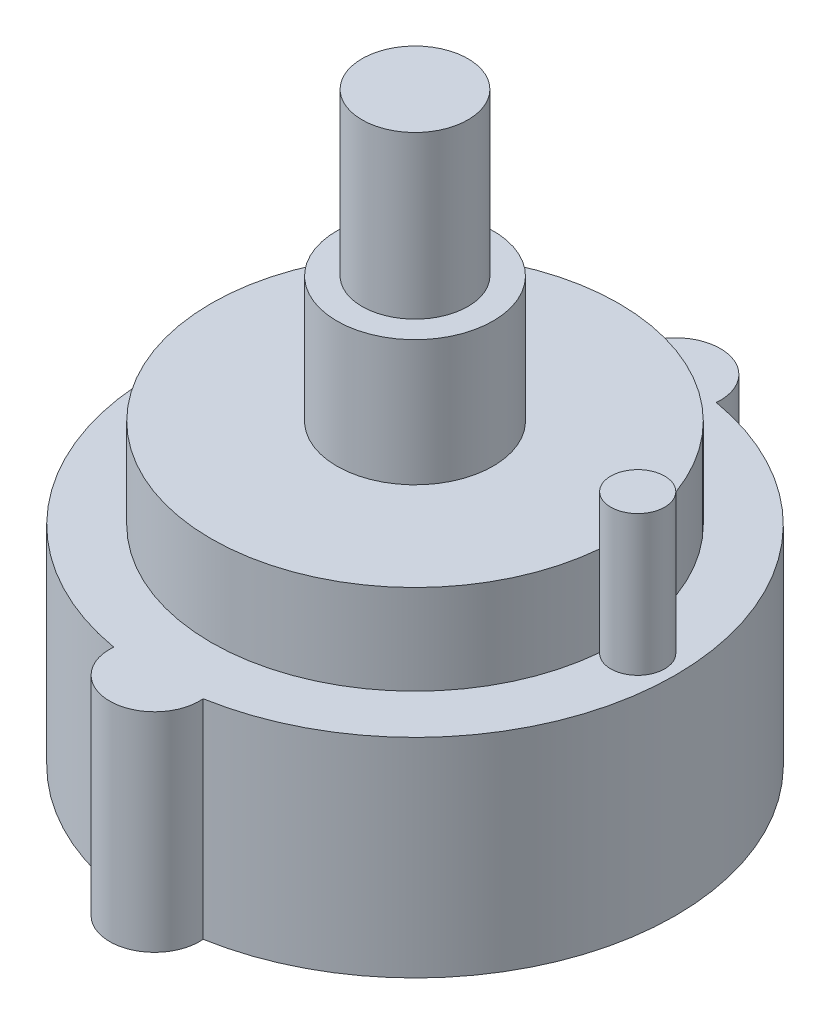
ISO-10303-21;
HEADER;
FILE_DESCRIPTION(('STEP AP214'),'2;1');
FILE_NAME('part.step','',(''),(''),'','','');
FILE_SCHEMA(('AUTOMOTIVE_DESIGN { 1 0 10303 214 1 1 1 1 }'));
ENDSEC;
DATA;
#1=APPLICATION_CONTEXT('core data for automotive mechanical design processes');
#2=APPLICATION_PROTOCOL_DEFINITION('international standard','automotive_design',2000,#1);
#3=PRODUCT_CONTEXT('',#1,'mechanical');
#4=PRODUCT('Part','Part','',(#3));
#5=PRODUCT_RELATED_PRODUCT_CATEGORY('part','',(#4));
#6=PRODUCT_DEFINITION_FORMATION('','',#4);
#7=PRODUCT_DEFINITION_CONTEXT('part definition',#1,'design');
#8=PRODUCT_DEFINITION('design','',#6,#7);
#9=PRODUCT_DEFINITION_SHAPE('','',#8);
#10=(LENGTH_UNIT() NAMED_UNIT(*) SI_UNIT(.MILLI.,.METRE.));
#11=(NAMED_UNIT(*) PLANE_ANGLE_UNIT() SI_UNIT($,.RADIAN.));
#12=(NAMED_UNIT(*) SI_UNIT($,.STERADIAN.) SOLID_ANGLE_UNIT());
#13=UNCERTAINTY_MEASURE_WITH_UNIT(LENGTH_MEASURE(1.E-05),#10,'distance_accuracy_value','');
#14=(GEOMETRIC_REPRESENTATION_CONTEXT(3) GLOBAL_UNCERTAINTY_ASSIGNED_CONTEXT((#13)) GLOBAL_UNIT_ASSIGNED_CONTEXT((#10,
#11,#12)) REPRESENTATION_CONTEXT('',''));
#15=CARTESIAN_POINT('',(0.,0.,0.));
#16=DIRECTION('',(0.,0.,1.));
#17=DIRECTION('',(1.,0.,0.));
#18=AXIS2_PLACEMENT_3D('',#15,#16,#17);
#19=CARTESIAN_POINT('',(0.,11.6,0.));
#20=DIRECTION('',(0.,-1.,0.));
#21=DIRECTION('',(0.,0.,-1.));
#22=AXIS2_PLACEMENT_3D('',#19,#20,#21);
#23=CYLINDRICAL_SURFACE('',#22,14.5);
#24=CARTESIAN_POINT('',(0.,0.,0.));
#25=DIRECTION('',(0.,1.,0.));
#26=DIRECTION('',(0.,0.,1.));
#27=AXIS2_PLACEMENT_3D('',#24,#25,#26);
#28=CIRCLE('',#27,14.5);
#29=CARTESIAN_POINT('',(2.4906931402058,0.,14.2844827586207));
#30=VERTEX_POINT('',#29);
#31=CARTESIAN_POINT('',(2.49069314020581,0.,-14.2844827586207));
#32=VERTEX_POINT('',#31);
#33=EDGE_CURVE('E143',#30,#32,#28,.T.);
#34=ORIENTED_EDGE('',*,*,#33,.T.);
#35=DIRECTION('',(0.,-1.,0.));
#36=VECTOR('',#35,1.);
#37=CARTESIAN_POINT('',(2.49069314020581,5.8,-14.2844827586207));
#38=LINE('',#37,#36);
#39=CARTESIAN_POINT('',(2.49069314020581,11.6,-14.2844827586207));
#40=VERTEX_POINT('',#39);
#41=EDGE_CURVE('E113',#32,#40,#38,.F.);
#42=ORIENTED_EDGE('',*,*,#41,.T.);
#43=CARTESIAN_POINT('',(0.,11.6,0.));
#44=DIRECTION('',(0.,1.,0.));
#45=DIRECTION('',(0.,0.,1.));
#46=AXIS2_PLACEMENT_3D('',#43,#44,#45);
#47=CIRCLE('',#46,14.5);
#48=CARTESIAN_POINT('',(2.49069314020581,11.6,14.2844827586207));
#49=VERTEX_POINT('',#48);
#50=EDGE_CURVE('E43',#49,#40,#47,.T.);
#51=ORIENTED_EDGE('',*,*,#50,.F.);
#52=DIRECTION('',(0.,-1.,0.));
#53=VECTOR('',#52,1.);
#54=CARTESIAN_POINT('',(2.49069314020581,5.8,14.2844827586207));
#55=LINE('',#54,#53);
#56=EDGE_CURVE('E122',#49,#30,#55,.T.);
#57=ORIENTED_EDGE('',*,*,#56,.T.);
#58=EDGE_LOOP('',(#34,#42,#51,#57));
#59=FACE_BOUND('',#58,.T.);
#60=ADVANCED_FACE('F35',(#59),#23,.T.);
#61=CARTESIAN_POINT('',(-2.49069314020581,11.6,-14.2844827586207));
#62=VERTEX_POINT('',#61);
#63=CARTESIAN_POINT('',(-2.49069314020581,11.6,14.2844827586207));
#64=VERTEX_POINT('',#63);
#65=EDGE_CURVE('E142',#62,#64,#47,.T.);
#66=ORIENTED_EDGE('',*,*,#65,.F.);
#67=DIRECTION('',(0.,-1.,0.));
#68=VECTOR('',#67,1.);
#69=CARTESIAN_POINT('',(-2.49069314020581,5.8,-14.2844827586207));
#70=LINE('',#69,#68);
#71=CARTESIAN_POINT('',(-2.4906931402058,0.,-14.2844827586207));
#72=VERTEX_POINT('',#71);
#73=EDGE_CURVE('E110',#62,#72,#70,.T.);
#74=ORIENTED_EDGE('',*,*,#73,.T.);
#75=CARTESIAN_POINT('',(-2.49069314020581,0.,14.2844827586207));
#76=VERTEX_POINT('',#75);
#77=EDGE_CURVE('E91',#72,#76,#28,.T.);
#78=ORIENTED_EDGE('',*,*,#77,.T.);
#79=DIRECTION('',(0.,-1.,0.));
#80=VECTOR('',#79,1.);
#81=CARTESIAN_POINT('',(-2.49069314020581,5.8,14.2844827586207));
#82=LINE('',#81,#80);
#83=EDGE_CURVE('E125',#76,#64,#82,.F.);
#84=ORIENTED_EDGE('',*,*,#83,.T.);
#85=EDGE_LOOP('',(#66,#74,#78,#84));
#86=FACE_BOUND('',#85,.T.);
#87=ADVANCED_FACE('F37',(#86),#23,.T.);
#88=CARTESIAN_POINT('',(0.,11.6,0.));
#89=DIRECTION('',(0.,1.,0.));
#90=DIRECTION('',(0.,0.,1.));
#91=AXIS2_PLACEMENT_3D('',#88,#89,#90);
#92=PLANE('',#91);
#93=CARTESIAN_POINT('',(12.4,11.6,0.));
#94=DIRECTION('',(0.,1.,0.));
#95=DIRECTION('',(0.,0.,1.));
#96=AXIS2_PLACEMENT_3D('',#93,#94,#95);
#97=CIRCLE('',#96,1.5);
#98=CARTESIAN_POINT('',(11.3037298387097,11.6,-1.02381235266258));
#99=VERTEX_POINT('',#98);
#100=CARTESIAN_POINT('',(11.3037298387097,11.6,1.02381235266258));
#101=VERTEX_POINT('',#100);
#102=EDGE_CURVE('E56',#99,#101,#97,.F.);
#103=ORIENTED_EDGE('',*,*,#102,.T.);
#104=CARTESIAN_POINT('',(0.,11.6,0.));
#105=DIRECTION('',(0.,1.,0.));
#106=DIRECTION('',(0.,0.,1.));
#107=AXIS2_PLACEMENT_3D('',#104,#105,#106);
#108=CIRCLE('',#107,11.35);
#109=EDGE_CURVE('E92',#99,#101,#108,.T.);
#110=ORIENTED_EDGE('',*,*,#109,.F.);
#111=EDGE_LOOP('',(#103,#110));
#112=FACE_BOUND('',#111,.T.);
#113=ORIENTED_EDGE('',*,*,#50,.T.);
#114=CARTESIAN_POINT('',(0.,11.6,-14.5));
#115=DIRECTION('',(0.,1.,0.));
#116=DIRECTION('',(0.,0.,1.));
#117=AXIS2_PLACEMENT_3D('',#114,#115,#116);
#118=CIRCLE('',#117,2.5);
#119=EDGE_CURVE('E108',#62,#40,#118,.F.);
#120=ORIENTED_EDGE('',*,*,#119,.F.);
#121=ORIENTED_EDGE('',*,*,#65,.T.);
#122=CARTESIAN_POINT('',(0.,11.6,14.5));
#123=DIRECTION('',(0.,1.,0.));
#124=DIRECTION('',(0.,0.,1.));
#125=AXIS2_PLACEMENT_3D('',#122,#123,#124);
#126=CIRCLE('',#125,2.5);
#127=EDGE_CURVE('E119',#49,#64,#126,.F.);
#128=ORIENTED_EDGE('',*,*,#127,.F.);
#129=EDGE_LOOP('',(#113,#120,#121,#128));
#130=FACE_BOUND('',#129,.T.);
#131=ADVANCED_FACE('F161',(#112,#130),#92,.T.);
#132=CARTESIAN_POINT('',(0.,0.,0.));
#133=DIRECTION('',(0.,1.,0.));
#134=DIRECTION('',(0.,0.,1.));
#135=AXIS2_PLACEMENT_3D('',#132,#133,#134);
#136=PLANE('',#135);
#137=ORIENTED_EDGE('',*,*,#77,.F.);
#138=CARTESIAN_POINT('',(0.,0.,-14.5));
#139=DIRECTION('',(0.,-1.,0.));
#140=DIRECTION('',(0.,0.,-1.));
#141=AXIS2_PLACEMENT_3D('',#138,#139,#140);
#142=CIRCLE('',#141,2.5);
#143=EDGE_CURVE('E98',#72,#32,#142,.T.);
#144=ORIENTED_EDGE('',*,*,#143,.T.);
#145=ORIENTED_EDGE('',*,*,#33,.F.);
#146=CARTESIAN_POINT('',(0.,0.,14.5));
#147=DIRECTION('',(0.,-1.,0.));
#148=DIRECTION('',(0.,0.,-1.));
#149=AXIS2_PLACEMENT_3D('',#146,#147,#148);
#150=CIRCLE('',#149,2.5);
#151=EDGE_CURVE('E116',#30,#76,#150,.T.);
#152=ORIENTED_EDGE('',*,*,#151,.T.);
#153=EDGE_LOOP('',(#137,#144,#145,#152));
#154=FACE_BOUND('',#153,.T.);
#155=ADVANCED_FACE('F155',(#154),#136,.F.);
#156=CARTESIAN_POINT('',(0.,16.6,0.));
#157=DIRECTION('',(0.,-1.,0.));
#158=DIRECTION('',(0.,0.,-1.));
#159=AXIS2_PLACEMENT_3D('',#156,#157,#158);
#160=CYLINDRICAL_SURFACE('',#159,11.35);
#161=ORIENTED_EDGE('',*,*,#109,.T.);
#162=DIRECTION('',(0.,1.,0.));
#163=VECTOR('',#162,1.);
#164=CARTESIAN_POINT('',(11.3037298387097,14.1,1.02381235266258));
#165=LINE('',#164,#163);
#166=CARTESIAN_POINT('',(11.3037298387097,16.6,1.02381235266258));
#167=VERTEX_POINT('',#166);
#168=EDGE_CURVE('E95',#101,#167,#165,.T.);
#169=ORIENTED_EDGE('',*,*,#168,.T.);
#170=CARTESIAN_POINT('',(0.,16.6,0.));
#171=DIRECTION('',(0.,1.,0.));
#172=DIRECTION('',(0.,0.,1.));
#173=AXIS2_PLACEMENT_3D('',#170,#171,#172);
#174=CIRCLE('',#173,11.35);
#175=CARTESIAN_POINT('',(11.3037298387097,16.6,-1.02381235266258));
#176=VERTEX_POINT('',#175);
#177=EDGE_CURVE('E87',#176,#167,#174,.T.);
#178=ORIENTED_EDGE('',*,*,#177,.F.);
#179=DIRECTION('',(0.,1.,0.));
#180=VECTOR('',#179,1.);
#181=CARTESIAN_POINT('',(11.3037298387097,14.1,-1.02381235266258));
#182=LINE('',#181,#180);
#183=EDGE_CURVE('E50',#176,#99,#182,.F.);
#184=ORIENTED_EDGE('',*,*,#183,.T.);
#185=EDGE_LOOP('',(#161,#169,#178,#184));
#186=FACE_BOUND('',#185,.T.);
#187=ADVANCED_FACE('F96',(#186),#160,.T.);
#188=CARTESIAN_POINT('',(0.,16.6,0.));
#189=DIRECTION('',(0.,1.,0.));
#190=DIRECTION('',(0.,0.,1.));
#191=AXIS2_PLACEMENT_3D('',#188,#189,#190);
#192=PLANE('',#191);
#193=CARTESIAN_POINT('',(12.4,16.6,0.));
#194=DIRECTION('',(0.,1.,0.));
#195=DIRECTION('',(0.,0.,1.));
#196=AXIS2_PLACEMENT_3D('',#193,#194,#195);
#197=CIRCLE('',#196,1.5);
#198=EDGE_CURVE('E11',#176,#167,#197,.T.);
#199=ORIENTED_EDGE('',*,*,#198,.F.);
#200=ORIENTED_EDGE('',*,*,#177,.T.);
#201=EDGE_LOOP('',(#199,#200));
#202=FACE_BOUND('',#201,.T.);
#203=CARTESIAN_POINT('',(0.,16.6,0.));
#204=DIRECTION('',(0.,1.,0.));
#205=DIRECTION('',(0.,0.,1.));
#206=AXIS2_PLACEMENT_3D('',#203,#204,#205);
#207=CIRCLE('',#206,4.35);
#208=CARTESIAN_POINT('',(0.,16.6,4.35));
#209=VERTEX_POINT('',#208);
#210=EDGE_CURVE('E132',#209,#209,#207,.T.);
#211=ORIENTED_EDGE('',*,*,#210,.F.);
#212=EDGE_LOOP('',(#211));
#213=FACE_BOUND('',#212,.T.);
#214=ADVANCED_FACE('F89',(#202,#213),#192,.T.);
#215=CARTESIAN_POINT('',(0.,23.6,0.));
#216=DIRECTION('',(0.,-1.,0.));
#217=DIRECTION('',(0.,0.,-1.));
#218=AXIS2_PLACEMENT_3D('',#215,#216,#217);
#219=CYLINDRICAL_SURFACE('',#218,4.35);
#220=CARTESIAN_POINT('',(0.,23.6,0.));
#221=DIRECTION('',(0.,1.,0.));
#222=DIRECTION('',(0.,0.,1.));
#223=AXIS2_PLACEMENT_3D('',#220,#221,#222);
#224=CIRCLE('',#223,4.35);
#225=CARTESIAN_POINT('',(0.,23.6,4.35));
#226=VERTEX_POINT('',#225);
#227=EDGE_CURVE('E135',#226,#226,#224,.T.);
#228=ORIENTED_EDGE('',*,*,#227,.F.);
#229=EDGE_LOOP('',(#228));
#230=FACE_BOUND('',#229,.T.);
#231=ORIENTED_EDGE('',*,*,#210,.T.);
#232=EDGE_LOOP('',(#231));
#233=FACE_BOUND('',#232,.T.);
#234=ADVANCED_FACE('F227',(#230,#233),#219,.T.);
#235=CARTESIAN_POINT('',(0.,23.6,0.));
#236=DIRECTION('',(0.,1.,0.));
#237=DIRECTION('',(0.,0.,1.));
#238=AXIS2_PLACEMENT_3D('',#235,#236,#237);
#239=PLANE('',#238);
#240=CARTESIAN_POINT('',(0.,23.6,0.));
#241=DIRECTION('',(0.,1.,0.));
#242=DIRECTION('',(0.,0.,1.));
#243=AXIS2_PLACEMENT_3D('',#240,#241,#242);
#244=CIRCLE('',#243,2.95);
#245=CARTESIAN_POINT('',(0.,23.6,2.95));
#246=VERTEX_POINT('',#245);
#247=EDGE_CURVE('E128',#246,#246,#244,.T.);
#248=ORIENTED_EDGE('',*,*,#247,.F.);
#249=EDGE_LOOP('',(#248));
#250=FACE_BOUND('',#249,.T.);
#251=ORIENTED_EDGE('',*,*,#227,.T.);
#252=EDGE_LOOP('',(#251));
#253=FACE_BOUND('',#252,.T.);
#254=ADVANCED_FACE('F257',(#250,#253),#239,.T.);
#255=CARTESIAN_POINT('',(0.,32.6,0.));
#256=DIRECTION('',(0.,-1.,0.));
#257=DIRECTION('',(0.,0.,-1.));
#258=AXIS2_PLACEMENT_3D('',#255,#256,#257);
#259=CYLINDRICAL_SURFACE('',#258,2.95);
#260=CARTESIAN_POINT('',(0.,32.6,0.));
#261=DIRECTION('',(0.,1.,0.));
#262=DIRECTION('',(0.,0.,1.));
#263=AXIS2_PLACEMENT_3D('',#260,#261,#262);
#264=CIRCLE('',#263,2.95);
#265=CARTESIAN_POINT('',(0.,32.6,2.95));
#266=VERTEX_POINT('',#265);
#267=EDGE_CURVE('E129',#266,#266,#264,.T.);
#268=ORIENTED_EDGE('',*,*,#267,.F.);
#269=EDGE_LOOP('',(#268));
#270=FACE_BOUND('',#269,.T.);
#271=ORIENTED_EDGE('',*,*,#247,.T.);
#272=EDGE_LOOP('',(#271));
#273=FACE_BOUND('',#272,.T.);
#274=ADVANCED_FACE('F253',(#270,#273),#259,.T.);
#275=CARTESIAN_POINT('',(0.,32.6,0.));
#276=DIRECTION('',(0.,1.,0.));
#277=DIRECTION('',(0.,0.,1.));
#278=AXIS2_PLACEMENT_3D('',#275,#276,#277);
#279=PLANE('',#278);
#280=ORIENTED_EDGE('',*,*,#267,.T.);
#281=EDGE_LOOP('',(#280));
#282=FACE_BOUND('',#281,.T.);
#283=ADVANCED_FACE('F195',(#282),#279,.T.);
#284=CARTESIAN_POINT('',(0.,18.6710678118655,14.5));
#285=DIRECTION('',(0.,-1.,0.));
#286=DIRECTION('',(0.,0.,-1.));
#287=AXIS2_PLACEMENT_3D('',#284,#285,#286);
#288=CYLINDRICAL_SURFACE('',#287,2.5);
#289=ORIENTED_EDGE('',*,*,#83,.F.);
#290=ORIENTED_EDGE('',*,*,#151,.F.);
#291=ORIENTED_EDGE('',*,*,#56,.F.);
#292=ORIENTED_EDGE('',*,*,#127,.T.);
#293=EDGE_LOOP('',(#289,#290,#291,#292));
#294=FACE_BOUND('',#293,.T.);
#295=ADVANCED_FACE('F153',(#294),#288,.T.);
#296=CARTESIAN_POINT('',(0.,18.6710678118655,-14.5));
#297=DIRECTION('',(0.,-1.,0.));
#298=DIRECTION('',(0.,0.,-1.));
#299=AXIS2_PLACEMENT_3D('',#296,#297,#298);
#300=CYLINDRICAL_SURFACE('',#299,2.5);
#301=ORIENTED_EDGE('',*,*,#41,.F.);
#302=ORIENTED_EDGE('',*,*,#143,.F.);
#303=ORIENTED_EDGE('',*,*,#73,.F.);
#304=ORIENTED_EDGE('',*,*,#119,.T.);
#305=EDGE_LOOP('',(#301,#302,#303,#304));
#306=FACE_BOUND('',#305,.T.);
#307=ADVANCED_FACE('F157',(#306),#300,.T.);
#308=CARTESIAN_POINT('',(12.4,7.35735931288071,0.));
#309=DIRECTION('',(0.,1.,0.));
#310=DIRECTION('',(0.,0.,1.));
#311=AXIS2_PLACEMENT_3D('',#308,#309,#310);
#312=CYLINDRICAL_SURFACE('',#311,1.5);
#313=CARTESIAN_POINT('',(12.4,19.4,0.));
#314=DIRECTION('',(0.,1.,0.));
#315=DIRECTION('',(0.,0.,1.));
#316=AXIS2_PLACEMENT_3D('',#313,#314,#315);
#317=CIRCLE('',#316,1.5);
#318=CARTESIAN_POINT('',(12.4,19.4,1.5));
#319=VERTEX_POINT('',#318);
#320=EDGE_CURVE('E102',#319,#319,#317,.T.);
#321=ORIENTED_EDGE('',*,*,#320,.F.);
#322=EDGE_LOOP('',(#321));
#323=FACE_BOUND('',#322,.T.);
#324=ORIENTED_EDGE('',*,*,#168,.F.);
#325=ORIENTED_EDGE('',*,*,#102,.F.);
#326=ORIENTED_EDGE('',*,*,#183,.F.);
#327=ORIENTED_EDGE('',*,*,#198,.T.);
#328=EDGE_LOOP('',(#324,#325,#326,#327));
#329=FACE_BOUND('',#328,.T.);
#330=ADVANCED_FACE('F100',(#323,#329),#312,.T.);
#331=CARTESIAN_POINT('',(12.4,19.4,0.));
#332=DIRECTION('',(0.,1.,0.));
#333=DIRECTION('',(0.,0.,1.));
#334=AXIS2_PLACEMENT_3D('',#331,#332,#333);
#335=PLANE('',#334);
#336=ORIENTED_EDGE('',*,*,#320,.T.);
#337=EDGE_LOOP('',(#336));
#338=FACE_BOUND('',#337,.T.);
#339=ADVANCED_FACE('F236',(#338),#335,.T.);
#340=CLOSED_SHELL('',(#60,#87,#131,#155,#187,#214,#234,#254,#274,#283,#295,#307,#330,#339));
#341=MANIFOLD_SOLID_BREP('B2',#340);
#342=ADVANCED_BREP_SHAPE_REPRESENTATION('',(#18,#341),#14);
#343=SHAPE_DEFINITION_REPRESENTATION(#9,#342);
ENDSEC;
END-ISO-10303-21;
